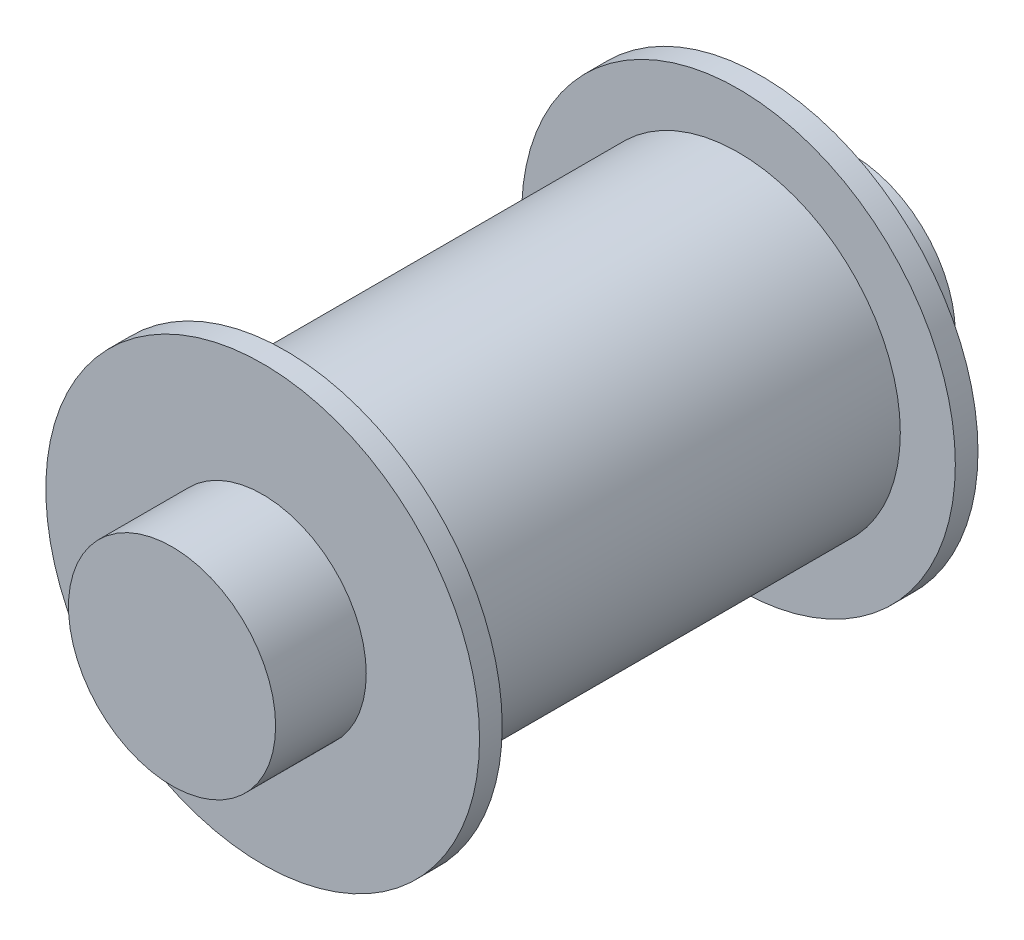
ISO-10303-21;
HEADER;
FILE_DESCRIPTION(('STEP AP214'),'2;1');
FILE_NAME('part.step','',(''),(''),'','','');
FILE_SCHEMA(('AUTOMOTIVE_DESIGN { 1 0 10303 214 1 1 1 1 }'));
ENDSEC;
DATA;
#1=APPLICATION_CONTEXT('core data for automotive mechanical design processes');
#2=APPLICATION_PROTOCOL_DEFINITION('international standard','automotive_design',2000,#1);
#3=PRODUCT_CONTEXT('',#1,'mechanical');
#4=PRODUCT('Part','Part','',(#3));
#5=PRODUCT_RELATED_PRODUCT_CATEGORY('part','',(#4));
#6=PRODUCT_DEFINITION_FORMATION('','',#4);
#7=PRODUCT_DEFINITION_CONTEXT('part definition',#1,'design');
#8=PRODUCT_DEFINITION('design','',#6,#7);
#9=PRODUCT_DEFINITION_SHAPE('','',#8);
#10=(LENGTH_UNIT() NAMED_UNIT(*) SI_UNIT(.MILLI.,.METRE.));
#11=(NAMED_UNIT(*) PLANE_ANGLE_UNIT() SI_UNIT($,.RADIAN.));
#12=(NAMED_UNIT(*) SI_UNIT($,.STERADIAN.) SOLID_ANGLE_UNIT());
#13=UNCERTAINTY_MEASURE_WITH_UNIT(LENGTH_MEASURE(1.E-05),#10,'distance_accuracy_value','');
#14=(GEOMETRIC_REPRESENTATION_CONTEXT(3) GLOBAL_UNCERTAINTY_ASSIGNED_CONTEXT((#13)) GLOBAL_UNIT_ASSIGNED_CONTEXT((#10,
#11,#12)) REPRESENTATION_CONTEXT('',''));
#15=CARTESIAN_POINT('',(0.,0.,0.));
#16=DIRECTION('',(0.,0.,1.));
#17=DIRECTION('',(1.,0.,0.));
#18=AXIS2_PLACEMENT_3D('',#15,#16,#17);
#19=CARTESIAN_POINT('',(0.,0.,52.5));
#20=DIRECTION('',(0.,0.,-1.));
#21=DIRECTION('',(-1.,0.,0.));
#22=AXIS2_PLACEMENT_3D('',#19,#20,#21);
#23=PLANE('',#22);
#24=CARTESIAN_POINT('',(0.,0.,52.5));
#25=DIRECTION('',(0.,0.,1.));
#26=DIRECTION('',(1.,0.,0.));
#27=AXIS2_PLACEMENT_3D('',#24,#25,#26);
#28=CIRCLE('',#27,16.);
#29=CARTESIAN_POINT('',(16.,0.,52.5));
#30=VERTEX_POINT('',#29);
#31=EDGE_CURVE('E80',#30,#30,#28,.T.);
#32=ORIENTED_EDGE('',*,*,#31,.T.);
#33=EDGE_LOOP('',(#32));
#34=FACE_BOUND('',#33,.T.);
#35=ADVANCED_FACE('F37',(#34),#23,.F.);
#36=CARTESIAN_POINT('',(0.,0.,-52.5));
#37=DIRECTION('',(0.,0.,1.));
#38=DIRECTION('',(1.,0.,0.));
#39=AXIS2_PLACEMENT_3D('',#36,#37,#38);
#40=PLANE('',#39);
#41=CARTESIAN_POINT('',(0.,0.,-52.5));
#42=DIRECTION('',(0.,0.,1.));
#43=DIRECTION('',(1.,0.,0.));
#44=AXIS2_PLACEMENT_3D('',#41,#42,#43);
#45=CIRCLE('',#44,16.);
#46=CARTESIAN_POINT('',(16.,0.,-52.5));
#47=VERTEX_POINT('',#46);
#48=EDGE_CURVE('E10',#47,#47,#45,.T.);
#49=ORIENTED_EDGE('',*,*,#48,.F.);
#50=EDGE_LOOP('',(#49));
#51=FACE_BOUND('',#50,.T.);
#52=ADVANCED_FACE('F135',(#51),#40,.F.);
#53=CARTESIAN_POINT('',(0.,0.,0.));
#54=DIRECTION('',(0.,0.,1.));
#55=DIRECTION('',(1.,0.,0.));
#56=AXIS2_PLACEMENT_3D('',#53,#54,#55);
#57=CYLINDRICAL_SURFACE('',#56,16.);
#58=CARTESIAN_POINT('',(0.,0.,-38.5));
#59=DIRECTION('',(0.,0.,1.));
#60=DIRECTION('',(1.,0.,0.));
#61=AXIS2_PLACEMENT_3D('',#58,#59,#60);
#62=CIRCLE('',#61,16.);
#63=CARTESIAN_POINT('',(16.,0.,-38.5));
#64=VERTEX_POINT('',#63);
#65=EDGE_CURVE('E44',#64,#64,#62,.T.);
#66=ORIENTED_EDGE('',*,*,#65,.F.);
#67=EDGE_LOOP('',(#66));
#68=FACE_BOUND('',#67,.T.);
#69=ORIENTED_EDGE('',*,*,#48,.T.);
#70=EDGE_LOOP('',(#69));
#71=FACE_BOUND('',#70,.T.);
#72=ADVANCED_FACE('F130',(#68,#71),#57,.T.);
#73=CARTESIAN_POINT('',(0.,16.,-38.5));
#74=DIRECTION('',(0.,0.,1.));
#75=DIRECTION('',(1.,0.,0.));
#76=AXIS2_PLACEMENT_3D('',#73,#74,#75);
#77=PLANE('',#76);
#78=CARTESIAN_POINT('',(0.,0.,-38.5));
#79=DIRECTION('',(0.,0.,1.));
#80=DIRECTION('',(1.,0.,0.));
#81=AXIS2_PLACEMENT_3D('',#78,#79,#80);
#82=CIRCLE('',#81,33.5);
#83=CARTESIAN_POINT('',(33.5,0.,-38.5));
#84=VERTEX_POINT('',#83);
#85=EDGE_CURVE('E49',#84,#84,#82,.T.);
#86=ORIENTED_EDGE('',*,*,#85,.F.);
#87=EDGE_LOOP('',(#86));
#88=FACE_BOUND('',#87,.T.);
#89=ORIENTED_EDGE('',*,*,#65,.T.);
#90=EDGE_LOOP('',(#89));
#91=FACE_BOUND('',#90,.T.);
#92=ADVANCED_FACE('F125',(#88,#91),#77,.F.);
#93=CARTESIAN_POINT('',(0.,0.,0.));
#94=DIRECTION('',(0.,0.,1.));
#95=DIRECTION('',(1.,0.,0.));
#96=AXIS2_PLACEMENT_3D('',#93,#94,#95);
#97=CYLINDRICAL_SURFACE('',#96,33.5);
#98=CARTESIAN_POINT('',(0.,0.,-35.));
#99=DIRECTION('',(0.,0.,1.));
#100=DIRECTION('',(1.,0.,0.));
#101=AXIS2_PLACEMENT_3D('',#98,#99,#100);
#102=CIRCLE('',#101,33.5);
#103=CARTESIAN_POINT('',(33.5,0.,-35.));
#104=VERTEX_POINT('',#103);
#105=EDGE_CURVE('E54',#104,#104,#102,.T.);
#106=ORIENTED_EDGE('',*,*,#105,.F.);
#107=EDGE_LOOP('',(#106));
#108=FACE_BOUND('',#107,.T.);
#109=ORIENTED_EDGE('',*,*,#85,.T.);
#110=EDGE_LOOP('',(#109));
#111=FACE_BOUND('',#110,.T.);
#112=ADVANCED_FACE('F119',(#108,#111),#97,.T.);
#113=CARTESIAN_POINT('',(0.,25.,-35.));
#114=DIRECTION('',(0.,0.,-1.));
#115=DIRECTION('',(-1.,0.,0.));
#116=AXIS2_PLACEMENT_3D('',#113,#114,#115);
#117=PLANE('',#116);
#118=CARTESIAN_POINT('',(0.,0.,-35.));
#119=DIRECTION('',(0.,0.,1.));
#120=DIRECTION('',(1.,0.,0.));
#121=AXIS2_PLACEMENT_3D('',#118,#119,#120);
#122=CIRCLE('',#121,25.);
#123=CARTESIAN_POINT('',(25.,0.,-35.));
#124=VERTEX_POINT('',#123);
#125=EDGE_CURVE('E60',#124,#124,#122,.T.);
#126=ORIENTED_EDGE('',*,*,#125,.F.);
#127=EDGE_LOOP('',(#126));
#128=FACE_BOUND('',#127,.T.);
#129=ORIENTED_EDGE('',*,*,#105,.T.);
#130=EDGE_LOOP('',(#129));
#131=FACE_BOUND('',#130,.T.);
#132=ADVANCED_FACE('F113',(#128,#131),#117,.F.);
#133=CARTESIAN_POINT('',(0.,0.,0.));
#134=DIRECTION('',(0.,0.,1.));
#135=DIRECTION('',(1.,0.,0.));
#136=AXIS2_PLACEMENT_3D('',#133,#134,#135);
#137=CYLINDRICAL_SURFACE('',#136,25.);
#138=CARTESIAN_POINT('',(0.,0.,35.));
#139=DIRECTION('',(0.,0.,1.));
#140=DIRECTION('',(1.,0.,0.));
#141=AXIS2_PLACEMENT_3D('',#138,#139,#140);
#142=CIRCLE('',#141,25.);
#143=CARTESIAN_POINT('',(25.,0.,35.));
#144=VERTEX_POINT('',#143);
#145=EDGE_CURVE('E64',#144,#144,#142,.T.);
#146=ORIENTED_EDGE('',*,*,#145,.F.);
#147=EDGE_LOOP('',(#146));
#148=FACE_BOUND('',#147,.T.);
#149=ORIENTED_EDGE('',*,*,#125,.T.);
#150=EDGE_LOOP('',(#149));
#151=FACE_BOUND('',#150,.T.);
#152=ADVANCED_FACE('F107',(#148,#151),#137,.T.);
#153=CARTESIAN_POINT('',(0.,33.5,35.));
#154=DIRECTION('',(0.,0.,1.));
#155=DIRECTION('',(1.,0.,0.));
#156=AXIS2_PLACEMENT_3D('',#153,#154,#155);
#157=PLANE('',#156);
#158=CARTESIAN_POINT('',(0.,0.,35.));
#159=DIRECTION('',(0.,0.,1.));
#160=DIRECTION('',(1.,0.,0.));
#161=AXIS2_PLACEMENT_3D('',#158,#159,#160);
#162=CIRCLE('',#161,33.5);
#163=CARTESIAN_POINT('',(33.5,0.,35.));
#164=VERTEX_POINT('',#163);
#165=EDGE_CURVE('E68',#164,#164,#162,.T.);
#166=ORIENTED_EDGE('',*,*,#165,.F.);
#167=EDGE_LOOP('',(#166));
#168=FACE_BOUND('',#167,.T.);
#169=ORIENTED_EDGE('',*,*,#145,.T.);
#170=EDGE_LOOP('',(#169));
#171=FACE_BOUND('',#170,.T.);
#172=ADVANCED_FACE('F101',(#168,#171),#157,.F.);
#173=CARTESIAN_POINT('',(0.,0.,0.));
#174=DIRECTION('',(0.,0.,1.));
#175=DIRECTION('',(1.,0.,0.));
#176=AXIS2_PLACEMENT_3D('',#173,#174,#175);
#177=CYLINDRICAL_SURFACE('',#176,33.5);
#178=CARTESIAN_POINT('',(0.,0.,38.5));
#179=DIRECTION('',(0.,0.,1.));
#180=DIRECTION('',(1.,0.,0.));
#181=AXIS2_PLACEMENT_3D('',#178,#179,#180);
#182=CIRCLE('',#181,33.5);
#183=CARTESIAN_POINT('',(33.5,0.,38.5));
#184=VERTEX_POINT('',#183);
#185=EDGE_CURVE('E72',#184,#184,#182,.T.);
#186=ORIENTED_EDGE('',*,*,#185,.F.);
#187=EDGE_LOOP('',(#186));
#188=FACE_BOUND('',#187,.T.);
#189=ORIENTED_EDGE('',*,*,#165,.T.);
#190=EDGE_LOOP('',(#189));
#191=FACE_BOUND('',#190,.T.);
#192=ADVANCED_FACE('F95',(#188,#191),#177,.T.);
#193=CARTESIAN_POINT('',(0.,16.,38.5));
#194=DIRECTION('',(0.,0.,-1.));
#195=DIRECTION('',(-1.,0.,0.));
#196=AXIS2_PLACEMENT_3D('',#193,#194,#195);
#197=PLANE('',#196);
#198=CARTESIAN_POINT('',(0.,0.,38.5));
#199=DIRECTION('',(0.,0.,1.));
#200=DIRECTION('',(1.,0.,0.));
#201=AXIS2_PLACEMENT_3D('',#198,#199,#200);
#202=CIRCLE('',#201,16.);
#203=CARTESIAN_POINT('',(16.,0.,38.5));
#204=VERTEX_POINT('',#203);
#205=EDGE_CURVE('E76',#204,#204,#202,.T.);
#206=ORIENTED_EDGE('',*,*,#205,.F.);
#207=EDGE_LOOP('',(#206));
#208=FACE_BOUND('',#207,.T.);
#209=ORIENTED_EDGE('',*,*,#185,.T.);
#210=EDGE_LOOP('',(#209));
#211=FACE_BOUND('',#210,.T.);
#212=ADVANCED_FACE('F89',(#208,#211),#197,.F.);
#213=CARTESIAN_POINT('',(0.,0.,0.));
#214=DIRECTION('',(0.,0.,1.));
#215=DIRECTION('',(1.,0.,0.));
#216=AXIS2_PLACEMENT_3D('',#213,#214,#215);
#217=CYLINDRICAL_SURFACE('',#216,16.);
#218=ORIENTED_EDGE('',*,*,#31,.F.);
#219=EDGE_LOOP('',(#218));
#220=FACE_BOUND('',#219,.T.);
#221=ORIENTED_EDGE('',*,*,#205,.T.);
#222=EDGE_LOOP('',(#221));
#223=FACE_BOUND('',#222,.T.);
#224=ADVANCED_FACE('F86',(#220,#223),#217,.T.);
#225=CLOSED_SHELL('',(#35,#52,#72,#92,#112,#132,#152,#172,#192,#212,#224));
#226=MANIFOLD_SOLID_BREP('B2',#225);
#227=ADVANCED_BREP_SHAPE_REPRESENTATION('',(#18,#226),#14);
#228=SHAPE_DEFINITION_REPRESENTATION(#9,#227);
ENDSEC;
END-ISO-10303-21;
